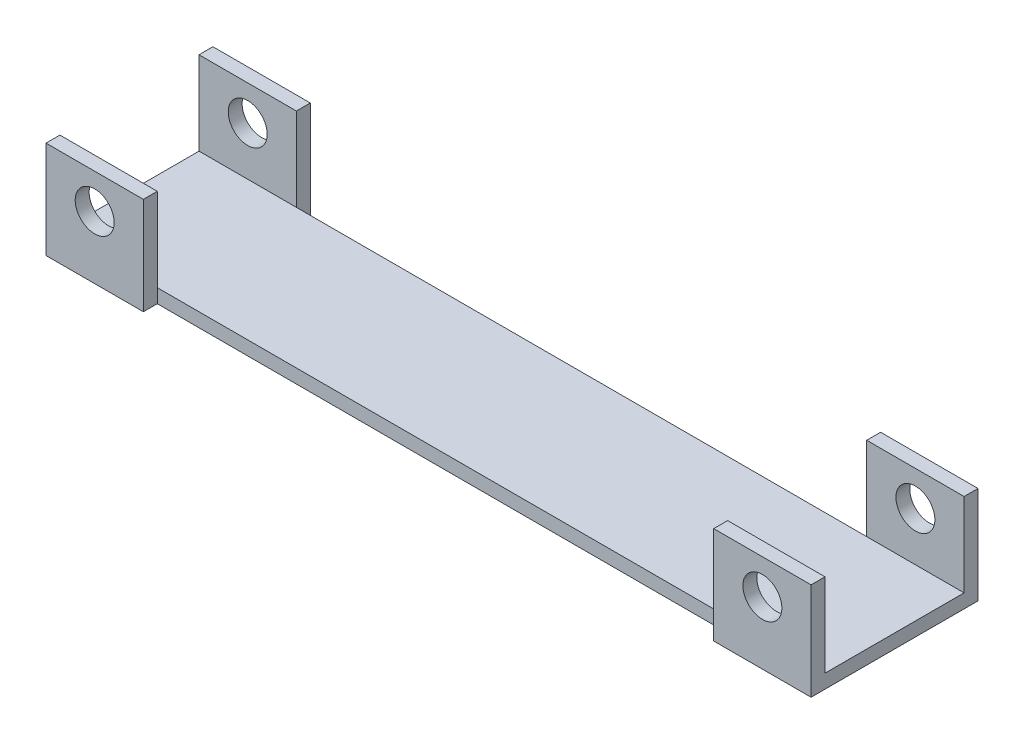
ISO-10303-21;
HEADER;
FILE_DESCRIPTION(('STEP AP214'),'2;1');
FILE_NAME('part.step','',(''),(''),'','','');
FILE_SCHEMA(('AUTOMOTIVE_DESIGN { 1 0 10303 214 1 1 1 1 }'));
ENDSEC;
DATA;
#1=APPLICATION_CONTEXT('core data for automotive mechanical design processes');
#2=APPLICATION_PROTOCOL_DEFINITION('international standard','automotive_design',2000,#1);
#3=PRODUCT_CONTEXT('',#1,'mechanical');
#4=PRODUCT('Part','Part','',(#3));
#5=PRODUCT_RELATED_PRODUCT_CATEGORY('part','',(#4));
#6=PRODUCT_DEFINITION_FORMATION('','',#4);
#7=PRODUCT_DEFINITION_CONTEXT('part definition',#1,'design');
#8=PRODUCT_DEFINITION('design','',#6,#7);
#9=PRODUCT_DEFINITION_SHAPE('','',#8);
#10=(LENGTH_UNIT() NAMED_UNIT(*) SI_UNIT(.MILLI.,.METRE.));
#11=(NAMED_UNIT(*) PLANE_ANGLE_UNIT() SI_UNIT($,.RADIAN.));
#12=(NAMED_UNIT(*) SI_UNIT($,.STERADIAN.) SOLID_ANGLE_UNIT());
#13=UNCERTAINTY_MEASURE_WITH_UNIT(LENGTH_MEASURE(1.E-05),#10,'distance_accuracy_value','');
#14=(GEOMETRIC_REPRESENTATION_CONTEXT(3) GLOBAL_UNCERTAINTY_ASSIGNED_CONTEXT((#13)) GLOBAL_UNIT_ASSIGNED_CONTEXT((#10,
#11,#12)) REPRESENTATION_CONTEXT('',''));
#15=CARTESIAN_POINT('',(0.,0.,0.));
#16=DIRECTION('',(0.,0.,1.));
#17=DIRECTION('',(1.,0.,0.));
#18=AXIS2_PLACEMENT_3D('',#15,#16,#17);
#19=CARTESIAN_POINT('',(0.,5.,0.));
#20=DIRECTION('',(0.,0.,-1.));
#21=DIRECTION('',(-1.,0.,0.));
#22=AXIS2_PLACEMENT_3D('',#19,#20,#21);
#23=PLANE('',#22);
#24=DIRECTION('',(0.,-1.,0.));
#25=VECTOR('',#24,1.);
#26=CARTESIAN_POINT('',(240.,0.,0.));
#27=LINE('',#26,#25);
#28=CARTESIAN_POINT('',(240.,5.,0.));
#29=VERTEX_POINT('',#28);
#30=CARTESIAN_POINT('',(240.,0.,0.));
#31=VERTEX_POINT('',#30);
#32=EDGE_CURVE('E256',#29,#31,#27,.T.);
#33=ORIENTED_EDGE('',*,*,#32,.F.);
#34=DIRECTION('',(1.,0.,0.));
#35=VECTOR('',#34,1.);
#36=CARTESIAN_POINT('',(0.,5.,0.));
#37=LINE('',#36,#35);
#38=CARTESIAN_POINT('',(35.,5.,0.));
#39=VERTEX_POINT('',#38);
#40=EDGE_CURVE('E305',#39,#29,#37,.T.);
#41=ORIENTED_EDGE('',*,*,#40,.F.);
#42=DIRECTION('',(0.,1.,0.));
#43=VECTOR('',#42,1.);
#44=CARTESIAN_POINT('',(35.,0.,0.));
#45=LINE('',#44,#43);
#46=CARTESIAN_POINT('',(35.,0.,0.));
#47=VERTEX_POINT('',#46);
#48=EDGE_CURVE('E290',#47,#39,#45,.T.);
#49=ORIENTED_EDGE('',*,*,#48,.F.);
#50=DIRECTION('',(1.,0.,0.));
#51=VECTOR('',#50,1.);
#52=CARTESIAN_POINT('',(0.,0.,0.));
#53=LINE('',#52,#51);
#54=EDGE_CURVE('E311',#47,#31,#53,.T.);
#55=ORIENTED_EDGE('',*,*,#54,.T.);
#56=EDGE_LOOP('',(#33,#41,#49,#55));
#57=FACE_BOUND('',#56,.T.);
#58=ADVANCED_FACE('F35',(#57),#23,.F.);
#59=CARTESIAN_POINT('',(0.,5.,0.));
#60=DIRECTION('',(1.,0.,0.));
#61=DIRECTION('',(0.,0.,-1.));
#62=AXIS2_PLACEMENT_3D('',#59,#60,#61);
#63=PLANE('',#62);
#64=DIRECTION('',(0.,0.,1.));
#65=VECTOR('',#64,1.);
#66=CARTESIAN_POINT('',(0.,0.,0.));
#67=LINE('',#66,#65);
#68=CARTESIAN_POINT('',(0.,0.,-55.));
#69=VERTEX_POINT('',#68);
#70=CARTESIAN_POINT('',(0.,0.,5.));
#71=VERTEX_POINT('',#70);
#72=EDGE_CURVE('E302',#69,#71,#67,.T.);
#73=ORIENTED_EDGE('',*,*,#72,.T.);
#74=DIRECTION('',(0.,-1.,0.));
#75=VECTOR('',#74,1.);
#76=CARTESIAN_POINT('',(0.,0.,5.));
#77=LINE('',#76,#75);
#78=CARTESIAN_POINT('',(0.,35.,5.));
#79=VERTEX_POINT('',#78);
#80=EDGE_CURVE('E276',#79,#71,#77,.T.);
#81=ORIENTED_EDGE('',*,*,#80,.F.);
#82=DIRECTION('',(0.,0.,-1.));
#83=VECTOR('',#82,1.);
#84=CARTESIAN_POINT('',(0.,35.,5.));
#85=LINE('',#84,#83);
#86=CARTESIAN_POINT('',(0.,35.,0.));
#87=VERTEX_POINT('',#86);
#88=EDGE_CURVE('E286',#79,#87,#85,.T.);
#89=ORIENTED_EDGE('',*,*,#88,.T.);
#90=DIRECTION('',(0.,-1.,0.));
#91=VECTOR('',#90,1.);
#92=CARTESIAN_POINT('',(0.,0.,0.));
#93=LINE('',#92,#91);
#94=CARTESIAN_POINT('',(0.,5.,0.));
#95=VERTEX_POINT('',#94);
#96=EDGE_CURVE('E273',#87,#95,#93,.T.);
#97=ORIENTED_EDGE('',*,*,#96,.T.);
#98=DIRECTION('',(0.,0.,1.));
#99=VECTOR('',#98,1.);
#100=CARTESIAN_POINT('',(0.,5.,0.));
#101=LINE('',#100,#99);
#102=CARTESIAN_POINT('',(0.,5.,-50.));
#103=VERTEX_POINT('',#102);
#104=EDGE_CURVE('E303',#103,#95,#101,.T.);
#105=ORIENTED_EDGE('',*,*,#104,.F.);
#106=DIRECTION('',(0.,-1.,0.));
#107=VECTOR('',#106,1.);
#108=CARTESIAN_POINT('',(0.,0.,-50.));
#109=LINE('',#108,#107);
#110=CARTESIAN_POINT('',(0.,35.,-50.));
#111=VERTEX_POINT('',#110);
#112=EDGE_CURVE('E206',#111,#103,#109,.T.);
#113=ORIENTED_EDGE('',*,*,#112,.F.);
#114=DIRECTION('',(0.,0.,1.));
#115=VECTOR('',#114,1.);
#116=CARTESIAN_POINT('',(0.,35.,-55.));
#117=LINE('',#116,#115);
#118=CARTESIAN_POINT('',(0.,35.,-55.));
#119=VERTEX_POINT('',#118);
#120=EDGE_CURVE('E233',#119,#111,#117,.T.);
#121=ORIENTED_EDGE('',*,*,#120,.F.);
#122=DIRECTION('',(0.,-1.,0.));
#123=VECTOR('',#122,1.);
#124=CARTESIAN_POINT('',(0.,0.,-55.));
#125=LINE('',#124,#123);
#126=EDGE_CURVE('E209',#119,#69,#125,.T.);
#127=ORIENTED_EDGE('',*,*,#126,.T.);
#128=EDGE_LOOP('',(#73,#81,#89,#97,#105,#113,#121,#127));
#129=FACE_BOUND('',#128,.T.);
#130=ADVANCED_FACE('F37',(#129),#63,.F.);
#131=CARTESIAN_POINT('',(275.,5.,0.));
#132=DIRECTION('',(-1.,0.,0.));
#133=DIRECTION('',(0.,0.,1.));
#134=AXIS2_PLACEMENT_3D('',#131,#132,#133);
#135=PLANE('',#134);
#136=DIRECTION('',(0.,0.,-1.));
#137=VECTOR('',#136,1.);
#138=CARTESIAN_POINT('',(275.,0.,0.));
#139=LINE('',#138,#137);
#140=CARTESIAN_POINT('',(275.,0.,5.));
#141=VERTEX_POINT('',#140);
#142=CARTESIAN_POINT('',(275.,0.,-55.));
#143=VERTEX_POINT('',#142);
#144=EDGE_CURVE('E312',#141,#143,#139,.T.);
#145=ORIENTED_EDGE('',*,*,#144,.T.);
#146=DIRECTION('',(0.,1.,0.));
#147=VECTOR('',#146,1.);
#148=CARTESIAN_POINT('',(275.,0.,-55.));
#149=LINE('',#148,#147);
#150=CARTESIAN_POINT('',(275.,35.,-55.));
#151=VERTEX_POINT('',#150);
#152=EDGE_CURVE('E180',#143,#151,#149,.T.);
#153=ORIENTED_EDGE('',*,*,#152,.T.);
#154=DIRECTION('',(0.,0.,1.));
#155=VECTOR('',#154,1.);
#156=CARTESIAN_POINT('',(275.,35.,-55.));
#157=LINE('',#156,#155);
#158=CARTESIAN_POINT('',(275.,35.,-50.));
#159=VERTEX_POINT('',#158);
#160=EDGE_CURVE('E191',#151,#159,#157,.T.);
#161=ORIENTED_EDGE('',*,*,#160,.T.);
#162=DIRECTION('',(0.,1.,0.));
#163=VECTOR('',#162,1.);
#164=CARTESIAN_POINT('',(275.,0.,-50.));
#165=LINE('',#164,#163);
#166=CARTESIAN_POINT('',(275.,5.,-50.));
#167=VERTEX_POINT('',#166);
#168=EDGE_CURVE('E181',#167,#159,#165,.T.);
#169=ORIENTED_EDGE('',*,*,#168,.F.);
#170=DIRECTION('',(0.,0.,-1.));
#171=VECTOR('',#170,1.);
#172=CARTESIAN_POINT('',(275.,5.,0.));
#173=LINE('',#172,#171);
#174=CARTESIAN_POINT('',(275.,5.,0.));
#175=VERTEX_POINT('',#174);
#176=EDGE_CURVE('E308',#175,#167,#173,.T.);
#177=ORIENTED_EDGE('',*,*,#176,.F.);
#178=DIRECTION('',(0.,1.,0.));
#179=VECTOR('',#178,1.);
#180=CARTESIAN_POINT('',(275.,0.,0.));
#181=LINE('',#180,#179);
#182=CARTESIAN_POINT('',(275.,35.,0.));
#183=VERTEX_POINT('',#182);
#184=EDGE_CURVE('E239',#175,#183,#181,.T.);
#185=ORIENTED_EDGE('',*,*,#184,.T.);
#186=DIRECTION('',(0.,0.,-1.));
#187=VECTOR('',#186,1.);
#188=CARTESIAN_POINT('',(275.,35.,5.));
#189=LINE('',#188,#187);
#190=CARTESIAN_POINT('',(275.,35.,5.));
#191=VERTEX_POINT('',#190);
#192=EDGE_CURVE('E264',#191,#183,#189,.T.);
#193=ORIENTED_EDGE('',*,*,#192,.F.);
#194=DIRECTION('',(0.,1.,0.));
#195=VECTOR('',#194,1.);
#196=CARTESIAN_POINT('',(275.,0.,5.));
#197=LINE('',#196,#195);
#198=EDGE_CURVE('E245',#141,#191,#197,.T.);
#199=ORIENTED_EDGE('',*,*,#198,.F.);
#200=EDGE_LOOP('',(#145,#153,#161,#169,#177,#185,#193,#199));
#201=FACE_BOUND('',#200,.T.);
#202=ADVANCED_FACE('F364',(#201),#135,.F.);
#203=CARTESIAN_POINT('',(0.,5.,-50.));
#204=DIRECTION('',(0.,0.,1.));
#205=DIRECTION('',(1.,0.,0.));
#206=AXIS2_PLACEMENT_3D('',#203,#204,#205);
#207=PLANE('',#206);
#208=DIRECTION('',(-1.,0.,0.));
#209=VECTOR('',#208,1.);
#210=CARTESIAN_POINT('',(0.,5.,-50.));
#211=LINE('',#210,#209);
#212=CARTESIAN_POINT('',(240.,5.,-50.));
#213=VERTEX_POINT('',#212);
#214=CARTESIAN_POINT('',(35.,5.,-50.));
#215=VERTEX_POINT('',#214);
#216=EDGE_CURVE('E44',#213,#215,#211,.T.);
#217=ORIENTED_EDGE('',*,*,#216,.F.);
#218=DIRECTION('',(0.,-1.,0.));
#219=VECTOR('',#218,1.);
#220=CARTESIAN_POINT('',(240.,0.,-50.));
#221=LINE('',#220,#219);
#222=CARTESIAN_POINT('',(240.,0.,-50.));
#223=VERTEX_POINT('',#222);
#224=EDGE_CURVE('E196',#213,#223,#221,.T.);
#225=ORIENTED_EDGE('',*,*,#224,.T.);
#226=DIRECTION('',(-1.,0.,0.));
#227=VECTOR('',#226,1.);
#228=CARTESIAN_POINT('',(0.,0.,-50.));
#229=LINE('',#228,#227);
#230=CARTESIAN_POINT('',(35.,0.,-50.));
#231=VERTEX_POINT('',#230);
#232=EDGE_CURVE('E39',#223,#231,#229,.T.);
#233=ORIENTED_EDGE('',*,*,#232,.T.);
#234=DIRECTION('',(0.,1.,0.));
#235=VECTOR('',#234,1.);
#236=CARTESIAN_POINT('',(35.,0.,-50.));
#237=LINE('',#236,#235);
#238=EDGE_CURVE('E213',#231,#215,#237,.T.);
#239=ORIENTED_EDGE('',*,*,#238,.T.);
#240=EDGE_LOOP('',(#217,#225,#233,#239));
#241=FACE_BOUND('',#240,.T.);
#242=ADVANCED_FACE('F315',(#241),#207,.F.);
#243=CARTESIAN_POINT('',(0.,5.,0.));
#244=DIRECTION('',(0.,-1.,0.));
#245=DIRECTION('',(0.,0.,-1.));
#246=AXIS2_PLACEMENT_3D('',#243,#244,#245);
#247=PLANE('',#246);
#248=ORIENTED_EDGE('',*,*,#104,.T.);
#249=EDGE_CURVE('E306',#95,#39,#37,.T.);
#250=ORIENTED_EDGE('',*,*,#249,.T.);
#251=ORIENTED_EDGE('',*,*,#40,.T.);
#252=DIRECTION('',(1.,0.,0.));
#253=VECTOR('',#252,1.);
#254=CARTESIAN_POINT('',(0.,5.,0.));
#255=LINE('',#254,#253);
#256=EDGE_CURVE('E267',#29,#175,#255,.T.);
#257=ORIENTED_EDGE('',*,*,#256,.T.);
#258=ORIENTED_EDGE('',*,*,#176,.T.);
#259=EDGE_CURVE('E11',#167,#213,#211,.T.);
#260=ORIENTED_EDGE('',*,*,#259,.T.);
#261=ORIENTED_EDGE('',*,*,#216,.T.);
#262=EDGE_CURVE('E46',#215,#103,#211,.T.);
#263=ORIENTED_EDGE('',*,*,#262,.T.);
#264=EDGE_LOOP('',(#248,#250,#251,#257,#258,#260,#261,#263));
#265=FACE_BOUND('',#264,.T.);
#266=ADVANCED_FACE('F327',(#265),#247,.F.);
#267=CARTESIAN_POINT('',(0.,0.,0.));
#268=DIRECTION('',(0.,-1.,0.));
#269=DIRECTION('',(0.,0.,-1.));
#270=AXIS2_PLACEMENT_3D('',#267,#268,#269);
#271=PLANE('',#270);
#272=ORIENTED_EDGE('',*,*,#72,.F.);
#273=DIRECTION('',(1.,0.,0.));
#274=VECTOR('',#273,1.);
#275=CARTESIAN_POINT('',(0.,0.,-55.));
#276=LINE('',#275,#274);
#277=CARTESIAN_POINT('',(35.,0.,-55.));
#278=VERTEX_POINT('',#277);
#279=EDGE_CURVE('E219',#69,#278,#276,.T.);
#280=ORIENTED_EDGE('',*,*,#279,.T.);
#281=DIRECTION('',(0.,0.,1.));
#282=VECTOR('',#281,1.);
#283=CARTESIAN_POINT('',(35.,0.,-55.));
#284=LINE('',#283,#282);
#285=EDGE_CURVE('E222',#278,#231,#284,.T.);
#286=ORIENTED_EDGE('',*,*,#285,.T.);
#287=ORIENTED_EDGE('',*,*,#232,.F.);
#288=DIRECTION('',(0.,0.,1.));
#289=VECTOR('',#288,1.);
#290=CARTESIAN_POINT('',(240.,0.,-55.));
#291=LINE('',#290,#289);
#292=CARTESIAN_POINT('',(240.,0.,-55.));
#293=VERTEX_POINT('',#292);
#294=EDGE_CURVE('E161',#293,#223,#291,.T.);
#295=ORIENTED_EDGE('',*,*,#294,.F.);
#296=DIRECTION('',(1.,0.,0.));
#297=VECTOR('',#296,1.);
#298=CARTESIAN_POINT('',(275.,0.,-55.));
#299=LINE('',#298,#297);
#300=EDGE_CURVE('E164',#293,#143,#299,.T.);
#301=ORIENTED_EDGE('',*,*,#300,.T.);
#302=ORIENTED_EDGE('',*,*,#144,.F.);
#303=DIRECTION('',(1.,0.,0.));
#304=VECTOR('',#303,1.);
#305=CARTESIAN_POINT('',(275.,0.,5.));
#306=LINE('',#305,#304);
#307=CARTESIAN_POINT('',(240.,0.,5.));
#308=VERTEX_POINT('',#307);
#309=EDGE_CURVE('E242',#308,#141,#306,.T.);
#310=ORIENTED_EDGE('',*,*,#309,.F.);
#311=DIRECTION('',(0.,0.,-1.));
#312=VECTOR('',#311,1.);
#313=CARTESIAN_POINT('',(240.,0.,5.));
#314=LINE('',#313,#312);
#315=EDGE_CURVE('E252',#308,#31,#314,.T.);
#316=ORIENTED_EDGE('',*,*,#315,.T.);
#317=ORIENTED_EDGE('',*,*,#54,.F.);
#318=DIRECTION('',(0.,0.,-1.));
#319=VECTOR('',#318,1.);
#320=CARTESIAN_POINT('',(35.,0.,5.));
#321=LINE('',#320,#319);
#322=CARTESIAN_POINT('',(35.,0.,5.));
#323=VERTEX_POINT('',#322);
#324=EDGE_CURVE('E299',#323,#47,#321,.T.);
#325=ORIENTED_EDGE('',*,*,#324,.F.);
#326=DIRECTION('',(1.,0.,0.));
#327=VECTOR('',#326,1.);
#328=CARTESIAN_POINT('',(0.,0.,5.));
#329=LINE('',#328,#327);
#330=EDGE_CURVE('E279',#71,#323,#329,.T.);
#331=ORIENTED_EDGE('',*,*,#330,.F.);
#332=EDGE_LOOP('',(#272,#280,#286,#287,#295,#301,#302,#310,#316,#317,#325,#331));
#333=FACE_BOUND('',#332,.T.);
#334=ADVANCED_FACE('F163',(#333),#271,.T.);
#335=CARTESIAN_POINT('',(0.,0.,0.));
#336=DIRECTION('',(0.,0.,-1.));
#337=DIRECTION('',(-1.,0.,0.));
#338=AXIS2_PLACEMENT_3D('',#335,#336,#337);
#339=PLANE('',#338);
#340=CARTESIAN_POINT('',(17.5,22.5,0.));
#341=DIRECTION('',(0.,0.,1.));
#342=DIRECTION('',(1.,0.,0.));
#343=AXIS2_PLACEMENT_3D('',#340,#341,#342);
#344=CIRCLE('',#343,7.);
#345=CARTESIAN_POINT('',(24.5,22.5,0.));
#346=VERTEX_POINT('',#345);
#347=EDGE_CURVE('E269',#346,#346,#344,.T.);
#348=ORIENTED_EDGE('',*,*,#347,.T.);
#349=EDGE_LOOP('',(#348));
#350=FACE_BOUND('',#349,.T.);
#351=ORIENTED_EDGE('',*,*,#249,.F.);
#352=ORIENTED_EDGE('',*,*,#96,.F.);
#353=DIRECTION('',(-1.,0.,0.));
#354=VECTOR('',#353,1.);
#355=CARTESIAN_POINT('',(0.,35.,0.));
#356=LINE('',#355,#354);
#357=CARTESIAN_POINT('',(35.,35.,0.));
#358=VERTEX_POINT('',#357);
#359=EDGE_CURVE('E280',#358,#87,#356,.T.);
#360=ORIENTED_EDGE('',*,*,#359,.F.);
#361=EDGE_CURVE('E289',#39,#358,#45,.T.);
#362=ORIENTED_EDGE('',*,*,#361,.F.);
#363=EDGE_LOOP('',(#351,#352,#360,#362));
#364=FACE_BOUND('',#363,.T.);
#365=ADVANCED_FACE('F335',(#350,#364),#339,.T.);
#366=CARTESIAN_POINT('',(0.,0.,5.));
#367=DIRECTION('',(0.,0.,-1.));
#368=DIRECTION('',(-1.,0.,0.));
#369=AXIS2_PLACEMENT_3D('',#366,#367,#368);
#370=PLANE('',#369);
#371=ORIENTED_EDGE('',*,*,#80,.T.);
#372=ORIENTED_EDGE('',*,*,#330,.T.);
#373=DIRECTION('',(0.,1.,0.));
#374=VECTOR('',#373,1.);
#375=CARTESIAN_POINT('',(35.,0.,5.));
#376=LINE('',#375,#374);
#377=CARTESIAN_POINT('',(35.,35.,5.));
#378=VERTEX_POINT('',#377);
#379=EDGE_CURVE('E282',#323,#378,#376,.T.);
#380=ORIENTED_EDGE('',*,*,#379,.T.);
#381=DIRECTION('',(-1.,0.,0.));
#382=VECTOR('',#381,1.);
#383=CARTESIAN_POINT('',(0.,35.,5.));
#384=LINE('',#383,#382);
#385=EDGE_CURVE('E284',#378,#79,#384,.T.);
#386=ORIENTED_EDGE('',*,*,#385,.T.);
#387=EDGE_LOOP('',(#371,#372,#380,#386));
#388=FACE_BOUND('',#387,.T.);
#389=CARTESIAN_POINT('',(17.5,22.5,5.));
#390=DIRECTION('',(0.,0.,1.));
#391=DIRECTION('',(1.,0.,0.));
#392=AXIS2_PLACEMENT_3D('',#389,#390,#391);
#393=CIRCLE('',#392,7.);
#394=CARTESIAN_POINT('',(24.5,22.5,5.));
#395=VERTEX_POINT('',#394);
#396=EDGE_CURVE('E270',#395,#395,#393,.T.);
#397=ORIENTED_EDGE('',*,*,#396,.F.);
#398=EDGE_LOOP('',(#397));
#399=FACE_BOUND('',#398,.T.);
#400=ADVANCED_FACE('F410',(#388,#399),#370,.F.);
#401=CARTESIAN_POINT('',(35.,0.,5.));
#402=DIRECTION('',(-1.,0.,0.));
#403=DIRECTION('',(0.,0.,1.));
#404=AXIS2_PLACEMENT_3D('',#401,#402,#403);
#405=PLANE('',#404);
#406=ORIENTED_EDGE('',*,*,#48,.T.);
#407=ORIENTED_EDGE('',*,*,#361,.T.);
#408=DIRECTION('',(0.,0.,-1.));
#409=VECTOR('',#408,1.);
#410=CARTESIAN_POINT('',(35.,35.,5.));
#411=LINE('',#410,#409);
#412=EDGE_CURVE('E296',#378,#358,#411,.T.);
#413=ORIENTED_EDGE('',*,*,#412,.F.);
#414=ORIENTED_EDGE('',*,*,#379,.F.);
#415=ORIENTED_EDGE('',*,*,#324,.T.);
#416=EDGE_LOOP('',(#406,#407,#413,#414,#415));
#417=FACE_BOUND('',#416,.T.);
#418=ADVANCED_FACE('F406',(#417),#405,.F.);
#419=CARTESIAN_POINT('',(0.,35.,5.));
#420=DIRECTION('',(0.,-1.,0.));
#421=DIRECTION('',(0.,0.,-1.));
#422=AXIS2_PLACEMENT_3D('',#419,#420,#421);
#423=PLANE('',#422);
#424=ORIENTED_EDGE('',*,*,#359,.T.);
#425=ORIENTED_EDGE('',*,*,#88,.F.);
#426=ORIENTED_EDGE('',*,*,#385,.F.);
#427=ORIENTED_EDGE('',*,*,#412,.T.);
#428=EDGE_LOOP('',(#424,#425,#426,#427));
#429=FACE_BOUND('',#428,.T.);
#430=ADVANCED_FACE('F409',(#429),#423,.F.);
#431=CARTESIAN_POINT('',(17.5,22.5,5.));
#432=DIRECTION('',(0.,0.,-1.));
#433=DIRECTION('',(-1.,0.,0.));
#434=AXIS2_PLACEMENT_3D('',#431,#432,#433);
#435=CYLINDRICAL_SURFACE('',#434,7.);
#436=ORIENTED_EDGE('',*,*,#396,.T.);
#437=EDGE_LOOP('',(#436));
#438=FACE_BOUND('',#437,.T.);
#439=ORIENTED_EDGE('',*,*,#347,.F.);
#440=EDGE_LOOP('',(#439));
#441=FACE_BOUND('',#440,.T.);
#442=ADVANCED_FACE('F414',(#438,#441),#435,.F.);
#443=CARTESIAN_POINT('',(0.,0.,0.));
#444=DIRECTION('',(0.,0.,-1.));
#445=DIRECTION('',(-1.,0.,0.));
#446=AXIS2_PLACEMENT_3D('',#443,#444,#445);
#447=PLANE('',#446);
#448=CARTESIAN_POINT('',(257.5,22.5,0.));
#449=DIRECTION('',(0.,0.,1.));
#450=DIRECTION('',(-1.,0.,0.));
#451=AXIS2_PLACEMENT_3D('',#448,#449,#450);
#452=CIRCLE('',#451,6.99999999999999);
#453=CARTESIAN_POINT('',(250.5,22.5,0.));
#454=VERTEX_POINT('',#453);
#455=EDGE_CURVE('E235',#454,#454,#452,.T.);
#456=ORIENTED_EDGE('',*,*,#455,.T.);
#457=EDGE_LOOP('',(#456));
#458=FACE_BOUND('',#457,.T.);
#459=ORIENTED_EDGE('',*,*,#256,.F.);
#460=CARTESIAN_POINT('',(240.,35.,0.));
#461=VERTEX_POINT('',#460);
#462=EDGE_CURVE('E246',#461,#29,#27,.T.);
#463=ORIENTED_EDGE('',*,*,#462,.F.);
#464=DIRECTION('',(-1.,0.,0.));
#465=VECTOR('',#464,1.);
#466=CARTESIAN_POINT('',(275.,35.,0.));
#467=LINE('',#466,#465);
#468=EDGE_CURVE('E254',#183,#461,#467,.T.);
#469=ORIENTED_EDGE('',*,*,#468,.F.);
#470=ORIENTED_EDGE('',*,*,#184,.F.);
#471=EDGE_LOOP('',(#459,#463,#469,#470));
#472=FACE_BOUND('',#471,.T.);
#473=ADVANCED_FACE('F359',(#458,#472),#447,.T.);
#474=CARTESIAN_POINT('',(0.,0.,5.));
#475=DIRECTION('',(0.,0.,-1.));
#476=DIRECTION('',(-1.,0.,0.));
#477=AXIS2_PLACEMENT_3D('',#474,#475,#476);
#478=PLANE('',#477);
#479=ORIENTED_EDGE('',*,*,#309,.T.);
#480=ORIENTED_EDGE('',*,*,#198,.T.);
#481=DIRECTION('',(-1.,0.,0.));
#482=VECTOR('',#481,1.);
#483=CARTESIAN_POINT('',(275.,35.,5.));
#484=LINE('',#483,#482);
#485=CARTESIAN_POINT('',(240.,35.,5.));
#486=VERTEX_POINT('',#485);
#487=EDGE_CURVE('E248',#191,#486,#484,.T.);
#488=ORIENTED_EDGE('',*,*,#487,.T.);
#489=DIRECTION('',(0.,-1.,0.));
#490=VECTOR('',#489,1.);
#491=CARTESIAN_POINT('',(240.,0.,5.));
#492=LINE('',#491,#490);
#493=EDGE_CURVE('E250',#486,#308,#492,.T.);
#494=ORIENTED_EDGE('',*,*,#493,.T.);
#495=EDGE_LOOP('',(#479,#480,#488,#494));
#496=FACE_BOUND('',#495,.T.);
#497=CARTESIAN_POINT('',(257.5,22.5,5.));
#498=DIRECTION('',(0.,0.,1.));
#499=DIRECTION('',(-1.,0.,0.));
#500=AXIS2_PLACEMENT_3D('',#497,#498,#499);
#501=CIRCLE('',#500,6.99999999999999);
#502=CARTESIAN_POINT('',(250.5,22.5,5.));
#503=VERTEX_POINT('',#502);
#504=EDGE_CURVE('E236',#503,#503,#501,.T.);
#505=ORIENTED_EDGE('',*,*,#504,.F.);
#506=EDGE_LOOP('',(#505));
#507=FACE_BOUND('',#506,.T.);
#508=ADVANCED_FACE('F351',(#496,#507),#478,.F.);
#509=CARTESIAN_POINT('',(275.,35.,5.));
#510=DIRECTION('',(0.,-1.,0.));
#511=DIRECTION('',(0.,0.,-1.));
#512=AXIS2_PLACEMENT_3D('',#509,#510,#511);
#513=PLANE('',#512);
#514=ORIENTED_EDGE('',*,*,#468,.T.);
#515=DIRECTION('',(0.,0.,-1.));
#516=VECTOR('',#515,1.);
#517=CARTESIAN_POINT('',(240.,35.,5.));
#518=LINE('',#517,#516);
#519=EDGE_CURVE('E261',#486,#461,#518,.T.);
#520=ORIENTED_EDGE('',*,*,#519,.F.);
#521=ORIENTED_EDGE('',*,*,#487,.F.);
#522=ORIENTED_EDGE('',*,*,#192,.T.);
#523=EDGE_LOOP('',(#514,#520,#521,#522));
#524=FACE_BOUND('',#523,.T.);
#525=ADVANCED_FACE('F425',(#524),#513,.F.);
#526=CARTESIAN_POINT('',(240.,0.,5.));
#527=DIRECTION('',(1.,0.,0.));
#528=DIRECTION('',(0.,0.,-1.));
#529=AXIS2_PLACEMENT_3D('',#526,#527,#528);
#530=PLANE('',#529);
#531=ORIENTED_EDGE('',*,*,#462,.T.);
#532=ORIENTED_EDGE('',*,*,#32,.T.);
#533=ORIENTED_EDGE('',*,*,#315,.F.);
#534=ORIENTED_EDGE('',*,*,#493,.F.);
#535=ORIENTED_EDGE('',*,*,#519,.T.);
#536=EDGE_LOOP('',(#531,#532,#533,#534,#535));
#537=FACE_BOUND('',#536,.T.);
#538=ADVANCED_FACE('F345',(#537),#530,.F.);
#539=CARTESIAN_POINT('',(257.5,22.5,5.));
#540=DIRECTION('',(0.,0.,-1.));
#541=DIRECTION('',(-1.,0.,0.));
#542=AXIS2_PLACEMENT_3D('',#539,#540,#541);
#543=CYLINDRICAL_SURFACE('',#542,6.99999999999999);
#544=ORIENTED_EDGE('',*,*,#504,.T.);
#545=EDGE_LOOP('',(#544));
#546=FACE_BOUND('',#545,.T.);
#547=ORIENTED_EDGE('',*,*,#455,.F.);
#548=EDGE_LOOP('',(#547));
#549=FACE_BOUND('',#548,.T.);
#550=ADVANCED_FACE('F430',(#546,#549),#543,.F.);
#551=CARTESIAN_POINT('',(0.,0.,-50.));
#552=DIRECTION('',(0.,0.,1.));
#553=DIRECTION('',(-1.,0.,0.));
#554=AXIS2_PLACEMENT_3D('',#551,#552,#553);
#555=PLANE('',#554);
#556=CARTESIAN_POINT('',(17.5,22.5,-50.));
#557=DIRECTION('',(0.,0.,1.));
#558=DIRECTION('',(1.,0.,0.));
#559=AXIS2_PLACEMENT_3D('',#556,#557,#558);
#560=CIRCLE('',#559,7.);
#561=CARTESIAN_POINT('',(24.5,22.5,-50.));
#562=VERTEX_POINT('',#561);
#563=EDGE_CURVE('E170',#562,#562,#560,.T.);
#564=ORIENTED_EDGE('',*,*,#563,.F.);
#565=EDGE_LOOP('',(#564));
#566=FACE_BOUND('',#565,.T.);
#567=ORIENTED_EDGE('',*,*,#262,.F.);
#568=CARTESIAN_POINT('',(35.,35.,-50.));
#569=VERTEX_POINT('',#568);
#570=EDGE_CURVE('E227',#215,#569,#237,.T.);
#571=ORIENTED_EDGE('',*,*,#570,.T.);
#572=DIRECTION('',(-1.,0.,0.));
#573=VECTOR('',#572,1.);
#574=CARTESIAN_POINT('',(0.,35.,-50.));
#575=LINE('',#574,#573);
#576=EDGE_CURVE('E224',#569,#111,#575,.T.);
#577=ORIENTED_EDGE('',*,*,#576,.T.);
#578=ORIENTED_EDGE('',*,*,#112,.T.);
#579=EDGE_LOOP('',(#567,#571,#577,#578));
#580=FACE_BOUND('',#579,.T.);
#581=ADVANCED_FACE('F324',(#566,#580),#555,.T.);
#582=CARTESIAN_POINT('',(0.,35.,-55.));
#583=DIRECTION('',(0.,1.,0.));
#584=DIRECTION('',(0.,0.,1.));
#585=AXIS2_PLACEMENT_3D('',#582,#583,#584);
#586=PLANE('',#585);
#587=ORIENTED_EDGE('',*,*,#576,.F.);
#588=DIRECTION('',(0.,0.,1.));
#589=VECTOR('',#588,1.);
#590=CARTESIAN_POINT('',(35.,35.,-55.));
#591=LINE('',#590,#589);
#592=CARTESIAN_POINT('',(35.,35.,-55.));
#593=VERTEX_POINT('',#592);
#594=EDGE_CURVE('E230',#593,#569,#591,.T.);
#595=ORIENTED_EDGE('',*,*,#594,.F.);
#596=DIRECTION('',(-1.,0.,0.));
#597=VECTOR('',#596,1.);
#598=CARTESIAN_POINT('',(0.,35.,-55.));
#599=LINE('',#598,#597);
#600=EDGE_CURVE('E212',#593,#119,#599,.T.);
#601=ORIENTED_EDGE('',*,*,#600,.T.);
#602=ORIENTED_EDGE('',*,*,#120,.T.);
#603=EDGE_LOOP('',(#587,#595,#601,#602));
#604=FACE_BOUND('',#603,.T.);
#605=ADVANCED_FACE('F439',(#604),#586,.T.);
#606=CARTESIAN_POINT('',(35.,0.,-55.));
#607=DIRECTION('',(1.,0.,0.));
#608=DIRECTION('',(0.,0.,-1.));
#609=AXIS2_PLACEMENT_3D('',#606,#607,#608);
#610=PLANE('',#609);
#611=ORIENTED_EDGE('',*,*,#238,.F.);
#612=ORIENTED_EDGE('',*,*,#285,.F.);
#613=DIRECTION('',(0.,1.,0.));
#614=VECTOR('',#613,1.);
#615=CARTESIAN_POINT('',(35.,0.,-55.));
#616=LINE('',#615,#614);
#617=EDGE_CURVE('E216',#278,#593,#616,.T.);
#618=ORIENTED_EDGE('',*,*,#617,.T.);
#619=ORIENTED_EDGE('',*,*,#594,.T.);
#620=ORIENTED_EDGE('',*,*,#570,.F.);
#621=EDGE_LOOP('',(#611,#612,#618,#619,#620));
#622=FACE_BOUND('',#621,.T.);
#623=ADVANCED_FACE('F320',(#622),#610,.T.);
#624=CARTESIAN_POINT('',(0.,0.,-55.));
#625=DIRECTION('',(0.,0.,1.));
#626=DIRECTION('',(-1.,0.,0.));
#627=AXIS2_PLACEMENT_3D('',#624,#625,#626);
#628=PLANE('',#627);
#629=CARTESIAN_POINT('',(17.5,22.5,-55.));
#630=DIRECTION('',(0.,0.,1.));
#631=DIRECTION('',(1.,0.,0.));
#632=AXIS2_PLACEMENT_3D('',#629,#630,#631);
#633=CIRCLE('',#632,7.);
#634=CARTESIAN_POINT('',(24.5,22.5,-55.));
#635=VERTEX_POINT('',#634);
#636=EDGE_CURVE('E203',#635,#635,#633,.T.);
#637=ORIENTED_EDGE('',*,*,#636,.T.);
#638=EDGE_LOOP('',(#637));
#639=FACE_BOUND('',#638,.T.);
#640=ORIENTED_EDGE('',*,*,#126,.F.);
#641=ORIENTED_EDGE('',*,*,#600,.F.);
#642=ORIENTED_EDGE('',*,*,#617,.F.);
#643=ORIENTED_EDGE('',*,*,#279,.F.);
#644=EDGE_LOOP('',(#640,#641,#642,#643));
#645=FACE_BOUND('',#644,.T.);
#646=ADVANCED_FACE('F388',(#639,#645),#628,.F.);
#647=CARTESIAN_POINT('',(17.5,22.5,-55.));
#648=DIRECTION('',(0.,0.,1.));
#649=DIRECTION('',(1.,0.,0.));
#650=AXIS2_PLACEMENT_3D('',#647,#648,#649);
#651=CYLINDRICAL_SURFACE('',#650,7.);
#652=ORIENTED_EDGE('',*,*,#636,.F.);
#653=EDGE_LOOP('',(#652));
#654=FACE_BOUND('',#653,.T.);
#655=ORIENTED_EDGE('',*,*,#563,.T.);
#656=EDGE_LOOP('',(#655));
#657=FACE_BOUND('',#656,.T.);
#658=ADVANCED_FACE('F380',(#654,#657),#651,.F.);
#659=CARTESIAN_POINT('',(0.,0.,-50.));
#660=DIRECTION('',(0.,0.,1.));
#661=DIRECTION('',(-1.,0.,0.));
#662=AXIS2_PLACEMENT_3D('',#659,#660,#661);
#663=PLANE('',#662);
#664=CARTESIAN_POINT('',(257.5,22.5,-50.));
#665=DIRECTION('',(0.,0.,1.));
#666=DIRECTION('',(-1.,0.,0.));
#667=AXIS2_PLACEMENT_3D('',#664,#665,#666);
#668=CIRCLE('',#667,6.99999999999999);
#669=CARTESIAN_POINT('',(250.5,22.5,-50.));
#670=VERTEX_POINT('',#669);
#671=EDGE_CURVE('E370',#670,#670,#668,.T.);
#672=ORIENTED_EDGE('',*,*,#671,.F.);
#673=EDGE_LOOP('',(#672));
#674=FACE_BOUND('',#673,.T.);
#675=ORIENTED_EDGE('',*,*,#259,.F.);
#676=ORIENTED_EDGE('',*,*,#168,.T.);
#677=DIRECTION('',(-1.,0.,0.));
#678=VECTOR('',#677,1.);
#679=CARTESIAN_POINT('',(275.,35.,-50.));
#680=LINE('',#679,#678);
#681=CARTESIAN_POINT('',(240.,35.,-50.));
#682=VERTEX_POINT('',#681);
#683=EDGE_CURVE('E195',#159,#682,#680,.T.);
#684=ORIENTED_EDGE('',*,*,#683,.T.);
#685=EDGE_CURVE('E192',#682,#213,#221,.T.);
#686=ORIENTED_EDGE('',*,*,#685,.T.);
#687=EDGE_LOOP('',(#675,#676,#684,#686));
#688=FACE_BOUND('',#687,.T.);
#689=ADVANCED_FACE('F367',(#674,#688),#663,.T.);
#690=CARTESIAN_POINT('',(240.,0.,-55.));
#691=DIRECTION('',(-1.,0.,0.));
#692=DIRECTION('',(0.,0.,1.));
#693=AXIS2_PLACEMENT_3D('',#690,#691,#692);
#694=PLANE('',#693);
#695=ORIENTED_EDGE('',*,*,#685,.F.);
#696=DIRECTION('',(0.,0.,1.));
#697=VECTOR('',#696,1.);
#698=CARTESIAN_POINT('',(240.,35.,-55.));
#699=LINE('',#698,#697);
#700=CARTESIAN_POINT('',(240.,35.,-55.));
#701=VERTEX_POINT('',#700);
#702=EDGE_CURVE('E171',#701,#682,#699,.T.);
#703=ORIENTED_EDGE('',*,*,#702,.F.);
#704=DIRECTION('',(0.,-1.,0.));
#705=VECTOR('',#704,1.);
#706=CARTESIAN_POINT('',(240.,0.,-55.));
#707=LINE('',#706,#705);
#708=EDGE_CURVE('E177',#701,#293,#707,.T.);
#709=ORIENTED_EDGE('',*,*,#708,.T.);
#710=ORIENTED_EDGE('',*,*,#294,.T.);
#711=ORIENTED_EDGE('',*,*,#224,.F.);
#712=EDGE_LOOP('',(#695,#703,#709,#710,#711));
#713=FACE_BOUND('',#712,.T.);
#714=ADVANCED_FACE('F184',(#713),#694,.T.);
#715=CARTESIAN_POINT('',(275.,35.,-55.));
#716=DIRECTION('',(0.,1.,0.));
#717=DIRECTION('',(0.,0.,1.));
#718=AXIS2_PLACEMENT_3D('',#715,#716,#717);
#719=PLANE('',#718);
#720=ORIENTED_EDGE('',*,*,#683,.F.);
#721=ORIENTED_EDGE('',*,*,#160,.F.);
#722=DIRECTION('',(-1.,0.,0.));
#723=VECTOR('',#722,1.);
#724=CARTESIAN_POINT('',(275.,35.,-55.));
#725=LINE('',#724,#723);
#726=EDGE_CURVE('E185',#151,#701,#725,.T.);
#727=ORIENTED_EDGE('',*,*,#726,.T.);
#728=ORIENTED_EDGE('',*,*,#702,.T.);
#729=EDGE_LOOP('',(#720,#721,#727,#728));
#730=FACE_BOUND('',#729,.T.);
#731=ADVANCED_FACE('F386',(#730),#719,.T.);
#732=CARTESIAN_POINT('',(0.,0.,-55.));
#733=DIRECTION('',(0.,0.,1.));
#734=DIRECTION('',(-1.,0.,0.));
#735=AXIS2_PLACEMENT_3D('',#732,#733,#734);
#736=PLANE('',#735);
#737=CARTESIAN_POINT('',(257.5,22.5,-55.));
#738=DIRECTION('',(0.,0.,1.));
#739=DIRECTION('',(-1.,0.,0.));
#740=AXIS2_PLACEMENT_3D('',#737,#738,#739);
#741=CIRCLE('',#740,6.99999999999999);
#742=CARTESIAN_POINT('',(250.5,22.5,-55.));
#743=VERTEX_POINT('',#742);
#744=EDGE_CURVE('E368',#743,#743,#741,.T.);
#745=ORIENTED_EDGE('',*,*,#744,.T.);
#746=EDGE_LOOP('',(#745));
#747=FACE_BOUND('',#746,.T.);
#748=ORIENTED_EDGE('',*,*,#300,.F.);
#749=ORIENTED_EDGE('',*,*,#708,.F.);
#750=ORIENTED_EDGE('',*,*,#726,.F.);
#751=ORIENTED_EDGE('',*,*,#152,.F.);
#752=EDGE_LOOP('',(#748,#749,#750,#751));
#753=FACE_BOUND('',#752,.T.);
#754=ADVANCED_FACE('F175',(#747,#753),#736,.F.);
#755=CARTESIAN_POINT('',(257.5,22.5,-55.));
#756=DIRECTION('',(0.,0.,1.));
#757=DIRECTION('',(1.,0.,0.));
#758=AXIS2_PLACEMENT_3D('',#755,#756,#757);
#759=CYLINDRICAL_SURFACE('',#758,6.99999999999999);
#760=ORIENTED_EDGE('',*,*,#744,.F.);
#761=EDGE_LOOP('',(#760));
#762=FACE_BOUND('',#761,.T.);
#763=ORIENTED_EDGE('',*,*,#671,.T.);
#764=EDGE_LOOP('',(#763));
#765=FACE_BOUND('',#764,.T.);
#766=ADVANCED_FACE('F377',(#762,#765),#759,.F.);
#767=CLOSED_SHELL('',(#58,#130,#202,#242,#266,#334,#365,#400,#418,#430,#442,#473,#508,#525,#538,
#550,#581,#605,#623,#646,#658,#689,#714,#731,#754,#766));
#768=MANIFOLD_SOLID_BREP('B2',#767);
#769=ADVANCED_BREP_SHAPE_REPRESENTATION('',(#18,#768),#14);
#770=SHAPE_DEFINITION_REPRESENTATION(#9,#769);
ENDSEC;
END-ISO-10303-21;
